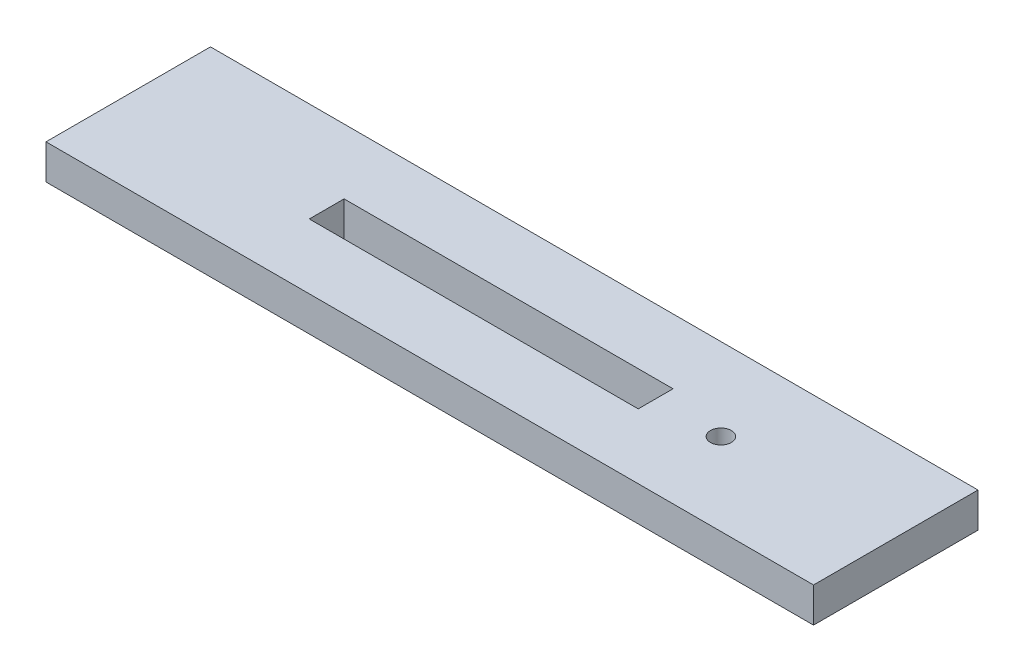
ISO-10303-21;
HEADER;
FILE_DESCRIPTION(('STEP AP214'),'2;1');
FILE_NAME('part.step','',(''),(''),'','','');
FILE_SCHEMA(('AUTOMOTIVE_DESIGN { 1 0 10303 214 1 1 1 1 }'));
ENDSEC;
DATA;
#1=APPLICATION_CONTEXT('core data for automotive mechanical design processes');
#2=APPLICATION_PROTOCOL_DEFINITION('international standard','automotive_design',2000,#1);
#3=PRODUCT_CONTEXT('',#1,'mechanical');
#4=PRODUCT('Part','Part','',(#3));
#5=PRODUCT_RELATED_PRODUCT_CATEGORY('part','',(#4));
#6=PRODUCT_DEFINITION_FORMATION('','',#4);
#7=PRODUCT_DEFINITION_CONTEXT('part definition',#1,'design');
#8=PRODUCT_DEFINITION('design','',#6,#7);
#9=PRODUCT_DEFINITION_SHAPE('','',#8);
#10=(LENGTH_UNIT() NAMED_UNIT(*) SI_UNIT(.MILLI.,.METRE.));
#11=(NAMED_UNIT(*) PLANE_ANGLE_UNIT() SI_UNIT($,.RADIAN.));
#12=(NAMED_UNIT(*) SI_UNIT($,.STERADIAN.) SOLID_ANGLE_UNIT());
#13=UNCERTAINTY_MEASURE_WITH_UNIT(LENGTH_MEASURE(1.E-05),#10,'distance_accuracy_value','');
#14=(GEOMETRIC_REPRESENTATION_CONTEXT(3) GLOBAL_UNCERTAINTY_ASSIGNED_CONTEXT((#13)) GLOBAL_UNIT_ASSIGNED_CONTEXT((#10,
#11,#12)) REPRESENTATION_CONTEXT('',''));
#15=CARTESIAN_POINT('',(0.,0.,0.));
#16=DIRECTION('',(0.,0.,1.));
#17=DIRECTION('',(1.,0.,0.));
#18=AXIS2_PLACEMENT_3D('',#15,#16,#17);
#19=CARTESIAN_POINT('',(0.,6.35,0.));
#20=DIRECTION('',(0.,-1.,0.));
#21=DIRECTION('',(0.,0.,-1.));
#22=AXIS2_PLACEMENT_3D('',#19,#20,#21);
#23=PLANE('',#22);
#24=CARTESIAN_POINT('',(38.1,6.35,2.43317159877705));
#25=DIRECTION('',(0.,1.,0.));
#26=DIRECTION('',(0.,0.,1.));
#27=AXIS2_PLACEMENT_3D('',#24,#25,#26);
#28=CIRCLE('',#27,1.9);
#29=CARTESIAN_POINT('',(38.1,6.35,4.33317159877705));
#30=VERTEX_POINT('',#29);
#31=EDGE_CURVE('E134',#30,#30,#28,.T.);
#32=ORIENTED_EDGE('',*,*,#31,.F.);
#33=EDGE_LOOP('',(#32));
#34=FACE_BOUND('',#33,.T.);
#35=DIRECTION('',(0.,0.,-1.));
#36=VECTOR('',#35,1.);
#37=CARTESIAN_POINT('',(70.,6.35,17.4331715987771));
#38=LINE('',#37,#36);
#39=CARTESIAN_POINT('',(70.,6.35,17.4331715987771));
#40=VERTEX_POINT('',#39);
#41=CARTESIAN_POINT('',(70.,6.35,-12.5668284012229));
#42=VERTEX_POINT('',#41);
#43=EDGE_CURVE('E140',#40,#42,#38,.T.);
#44=ORIENTED_EDGE('',*,*,#43,.T.);
#45=DIRECTION('',(-1.,0.,0.));
#46=VECTOR('',#45,1.);
#47=CARTESIAN_POINT('',(-70.,6.35,-12.5668284012229));
#48=LINE('',#47,#46);
#49=CARTESIAN_POINT('',(-70.,6.35,-12.5668284012229));
#50=VERTEX_POINT('',#49);
#51=EDGE_CURVE('E143',#42,#50,#48,.T.);
#52=ORIENTED_EDGE('',*,*,#51,.T.);
#53=DIRECTION('',(0.,0.,1.));
#54=VECTOR('',#53,1.);
#55=CARTESIAN_POINT('',(-70.,6.35,17.4331715987771));
#56=LINE('',#55,#54);
#57=CARTESIAN_POINT('',(-70.,6.35,17.4331715987771));
#58=VERTEX_POINT('',#57);
#59=EDGE_CURVE('E146',#50,#58,#56,.T.);
#60=ORIENTED_EDGE('',*,*,#59,.T.);
#61=DIRECTION('',(1.,0.,0.));
#62=VECTOR('',#61,1.);
#63=CARTESIAN_POINT('',(-70.,6.35,17.4331715987771));
#64=LINE('',#63,#62);
#65=EDGE_CURVE('E148',#58,#40,#64,.T.);
#66=ORIENTED_EDGE('',*,*,#65,.T.);
#67=EDGE_LOOP('',(#44,#52,#60,#66));
#68=FACE_BOUND('',#67,.T.);
#69=DIRECTION('',(0.,0.,1.));
#70=VECTOR('',#69,1.);
#71=CARTESIAN_POINT('',(-33.8,6.35,5.60817159877704));
#72=LINE('',#71,#70);
#73=CARTESIAN_POINT('',(-33.8,6.35,-0.741828401222962));
#74=VERTEX_POINT('',#73);
#75=CARTESIAN_POINT('',(-33.8,6.35,5.60817159877704));
#76=VERTEX_POINT('',#75);
#77=EDGE_CURVE('E98',#74,#76,#72,.T.);
#78=ORIENTED_EDGE('',*,*,#77,.F.);
#79=DIRECTION('',(-1.,0.,0.));
#80=VECTOR('',#79,1.);
#81=CARTESIAN_POINT('',(26.2,6.35,-0.741828401222999));
#82=LINE('',#81,#80);
#83=CARTESIAN_POINT('',(26.2,6.35,-0.741828401222999));
#84=VERTEX_POINT('',#83);
#85=EDGE_CURVE('E120',#84,#74,#82,.T.);
#86=ORIENTED_EDGE('',*,*,#85,.F.);
#87=DIRECTION('',(0.,0.,-1.));
#88=VECTOR('',#87,1.);
#89=CARTESIAN_POINT('',(26.2,6.35,5.60817159877703));
#90=LINE('',#89,#88);
#91=CARTESIAN_POINT('',(26.2,6.35,5.60817159877703));
#92=VERTEX_POINT('',#91);
#93=EDGE_CURVE('E118',#92,#84,#90,.T.);
#94=ORIENTED_EDGE('',*,*,#93,.F.);
#95=DIRECTION('',(1.,0.,0.));
#96=VECTOR('',#95,1.);
#97=CARTESIAN_POINT('',(26.2,6.35,5.60817159877703));
#98=LINE('',#97,#96);
#99=EDGE_CURVE('E106',#76,#92,#98,.T.);
#100=ORIENTED_EDGE('',*,*,#99,.F.);
#101=EDGE_LOOP('',(#78,#86,#94,#100));
#102=FACE_BOUND('',#101,.T.);
#103=ADVANCED_FACE('F33',(#34,#68,#102),#23,.F.);
#104=CARTESIAN_POINT('',(0.,0.,0.));
#105=DIRECTION('',(0.,-1.,0.));
#106=DIRECTION('',(0.,0.,-1.));
#107=AXIS2_PLACEMENT_3D('',#104,#105,#106);
#108=PLANE('',#107);
#109=DIRECTION('',(0.,0.,-1.));
#110=VECTOR('',#109,1.);
#111=CARTESIAN_POINT('',(70.,0.,17.4331715987771));
#112=LINE('',#111,#110);
#113=CARTESIAN_POINT('',(70.,0.,17.4331715987771));
#114=VERTEX_POINT('',#113);
#115=CARTESIAN_POINT('',(70.,0.,-12.5668284012229));
#116=VERTEX_POINT('',#115);
#117=EDGE_CURVE('E137',#114,#116,#112,.T.);
#118=ORIENTED_EDGE('',*,*,#117,.F.);
#119=DIRECTION('',(1.,0.,0.));
#120=VECTOR('',#119,1.);
#121=CARTESIAN_POINT('',(-70.,0.,17.4331715987771));
#122=LINE('',#121,#120);
#123=CARTESIAN_POINT('',(-70.,0.,17.4331715987771));
#124=VERTEX_POINT('',#123);
#125=EDGE_CURVE('E144',#124,#114,#122,.T.);
#126=ORIENTED_EDGE('',*,*,#125,.F.);
#127=DIRECTION('',(0.,0.,1.));
#128=VECTOR('',#127,1.);
#129=CARTESIAN_POINT('',(-70.,0.,17.4331715987771));
#130=LINE('',#129,#128);
#131=CARTESIAN_POINT('',(-70.,0.,-12.5668284012229));
#132=VERTEX_POINT('',#131);
#133=EDGE_CURVE('E155',#132,#124,#130,.T.);
#134=ORIENTED_EDGE('',*,*,#133,.F.);
#135=DIRECTION('',(-1.,0.,0.));
#136=VECTOR('',#135,1.);
#137=CARTESIAN_POINT('',(-70.,0.,-12.5668284012229));
#138=LINE('',#137,#136);
#139=EDGE_CURVE('E153',#116,#132,#138,.T.);
#140=ORIENTED_EDGE('',*,*,#139,.F.);
#141=EDGE_LOOP('',(#118,#126,#134,#140));
#142=FACE_BOUND('',#141,.T.);
#143=CARTESIAN_POINT('',(38.1,0.,2.43317159877705));
#144=DIRECTION('',(0.,1.,0.));
#145=DIRECTION('',(0.,0.,1.));
#146=AXIS2_PLACEMENT_3D('',#143,#144,#145);
#147=CIRCLE('',#146,1.9);
#148=CARTESIAN_POINT('',(38.1,0.,4.33317159877705));
#149=VERTEX_POINT('',#148);
#150=EDGE_CURVE('E114',#149,#149,#147,.T.);
#151=ORIENTED_EDGE('',*,*,#150,.T.);
#152=EDGE_LOOP('',(#151));
#153=FACE_BOUND('',#152,.T.);
#154=DIRECTION('',(-1.,0.,0.));
#155=VECTOR('',#154,1.);
#156=CARTESIAN_POINT('',(26.2,0.,-0.741828401222999));
#157=LINE('',#156,#155);
#158=CARTESIAN_POINT('',(26.2,0.,-0.741828401222999));
#159=VERTEX_POINT('',#158);
#160=CARTESIAN_POINT('',(-33.8,0.,-0.741828401222962));
#161=VERTEX_POINT('',#160);
#162=EDGE_CURVE('E107',#159,#161,#157,.T.);
#163=ORIENTED_EDGE('',*,*,#162,.T.);
#164=DIRECTION('',(0.,0.,1.));
#165=VECTOR('',#164,1.);
#166=CARTESIAN_POINT('',(-33.8,0.,5.60817159877704));
#167=LINE('',#166,#165);
#168=CARTESIAN_POINT('',(-33.8,0.,5.60817159877704));
#169=VERTEX_POINT('',#168);
#170=EDGE_CURVE('E56',#161,#169,#167,.T.);
#171=ORIENTED_EDGE('',*,*,#170,.T.);
#172=DIRECTION('',(1.,0.,0.));
#173=VECTOR('',#172,1.);
#174=CARTESIAN_POINT('',(26.2,0.,5.60817159877703));
#175=LINE('',#174,#173);
#176=CARTESIAN_POINT('',(26.2,0.,5.60817159877703));
#177=VERTEX_POINT('',#176);
#178=EDGE_CURVE('E113',#169,#177,#175,.T.);
#179=ORIENTED_EDGE('',*,*,#178,.T.);
#180=DIRECTION('',(0.,0.,-1.));
#181=VECTOR('',#180,1.);
#182=CARTESIAN_POINT('',(26.2,0.,5.60817159877703));
#183=LINE('',#182,#181);
#184=EDGE_CURVE('E126',#177,#159,#183,.T.);
#185=ORIENTED_EDGE('',*,*,#184,.T.);
#186=EDGE_LOOP('',(#163,#171,#179,#185));
#187=FACE_BOUND('',#186,.T.);
#188=ADVANCED_FACE('F173',(#142,#153,#187),#108,.T.);
#189=CARTESIAN_POINT('',(70.,6.35,17.4331715987771));
#190=DIRECTION('',(-1.,0.,0.));
#191=DIRECTION('',(0.,0.,1.));
#192=AXIS2_PLACEMENT_3D('',#189,#190,#191);
#193=PLANE('',#192);
#194=ORIENTED_EDGE('',*,*,#117,.T.);
#195=DIRECTION('',(0.,-1.,0.));
#196=VECTOR('',#195,1.);
#197=CARTESIAN_POINT('',(70.,6.35,-12.5668284012229));
#198=LINE('',#197,#196);
#199=EDGE_CURVE('E11',#42,#116,#198,.T.);
#200=ORIENTED_EDGE('',*,*,#199,.F.);
#201=ORIENTED_EDGE('',*,*,#43,.F.);
#202=DIRECTION('',(0.,-1.,0.));
#203=VECTOR('',#202,1.);
#204=CARTESIAN_POINT('',(70.,6.35,17.4331715987771));
#205=LINE('',#204,#203);
#206=EDGE_CURVE('E150',#40,#114,#205,.T.);
#207=ORIENTED_EDGE('',*,*,#206,.T.);
#208=EDGE_LOOP('',(#194,#200,#201,#207));
#209=FACE_BOUND('',#208,.T.);
#210=ADVANCED_FACE('F35',(#209),#193,.F.);
#211=CARTESIAN_POINT('',(-70.,6.35,-12.5668284012229));
#212=DIRECTION('',(0.,0.,1.));
#213=DIRECTION('',(1.,0.,0.));
#214=AXIS2_PLACEMENT_3D('',#211,#212,#213);
#215=PLANE('',#214);
#216=ORIENTED_EDGE('',*,*,#139,.T.);
#217=DIRECTION('',(0.,-1.,0.));
#218=VECTOR('',#217,1.);
#219=CARTESIAN_POINT('',(-70.,6.35,-12.5668284012229));
#220=LINE('',#219,#218);
#221=EDGE_CURVE('E41',#50,#132,#220,.T.);
#222=ORIENTED_EDGE('',*,*,#221,.F.);
#223=ORIENTED_EDGE('',*,*,#51,.F.);
#224=ORIENTED_EDGE('',*,*,#199,.T.);
#225=EDGE_LOOP('',(#216,#222,#223,#224));
#226=FACE_BOUND('',#225,.T.);
#227=ADVANCED_FACE('F183',(#226),#215,.F.);
#228=CARTESIAN_POINT('',(-70.,6.35,17.4331715987771));
#229=DIRECTION('',(1.,0.,0.));
#230=DIRECTION('',(0.,0.,-1.));
#231=AXIS2_PLACEMENT_3D('',#228,#229,#230);
#232=PLANE('',#231);
#233=ORIENTED_EDGE('',*,*,#133,.T.);
#234=DIRECTION('',(0.,-1.,0.));
#235=VECTOR('',#234,1.);
#236=CARTESIAN_POINT('',(-70.,6.35,17.4331715987771));
#237=LINE('',#236,#235);
#238=EDGE_CURVE('E160',#58,#124,#237,.T.);
#239=ORIENTED_EDGE('',*,*,#238,.F.);
#240=ORIENTED_EDGE('',*,*,#59,.F.);
#241=ORIENTED_EDGE('',*,*,#221,.T.);
#242=EDGE_LOOP('',(#233,#239,#240,#241));
#243=FACE_BOUND('',#242,.T.);
#244=ADVANCED_FACE('F167',(#243),#232,.F.);
#245=CARTESIAN_POINT('',(-70.,6.35,17.4331715987771));
#246=DIRECTION('',(0.,0.,-1.));
#247=DIRECTION('',(-1.,0.,0.));
#248=AXIS2_PLACEMENT_3D('',#245,#246,#247);
#249=PLANE('',#248);
#250=ORIENTED_EDGE('',*,*,#125,.T.);
#251=ORIENTED_EDGE('',*,*,#206,.F.);
#252=ORIENTED_EDGE('',*,*,#65,.F.);
#253=ORIENTED_EDGE('',*,*,#238,.T.);
#254=EDGE_LOOP('',(#250,#251,#252,#253));
#255=FACE_BOUND('',#254,.T.);
#256=ADVANCED_FACE('F177',(#255),#249,.F.);
#257=CARTESIAN_POINT('',(38.1,6.35,2.43317159877705));
#258=DIRECTION('',(0.,-1.,0.));
#259=DIRECTION('',(0.,0.,-1.));
#260=AXIS2_PLACEMENT_3D('',#257,#258,#259);
#261=CYLINDRICAL_SURFACE('',#260,1.9);
#262=ORIENTED_EDGE('',*,*,#31,.T.);
#263=EDGE_LOOP('',(#262));
#264=FACE_BOUND('',#263,.T.);
#265=ORIENTED_EDGE('',*,*,#150,.F.);
#266=EDGE_LOOP('',(#265));
#267=FACE_BOUND('',#266,.T.);
#268=ADVANCED_FACE('F199',(#264,#267),#261,.F.);
#269=CARTESIAN_POINT('',(-33.8,6.35,5.60817159877704));
#270=DIRECTION('',(1.,0.,0.));
#271=DIRECTION('',(0.,0.,-1.));
#272=AXIS2_PLACEMENT_3D('',#269,#270,#271);
#273=PLANE('',#272);
#274=ORIENTED_EDGE('',*,*,#170,.F.);
#275=DIRECTION('',(0.,-1.,0.));
#276=VECTOR('',#275,1.);
#277=CARTESIAN_POINT('',(-33.8,6.35,-0.741828401222962));
#278=LINE('',#277,#276);
#279=EDGE_CURVE('E102',#74,#161,#278,.T.);
#280=ORIENTED_EDGE('',*,*,#279,.F.);
#281=ORIENTED_EDGE('',*,*,#77,.T.);
#282=DIRECTION('',(0.,-1.,0.));
#283=VECTOR('',#282,1.);
#284=CARTESIAN_POINT('',(-33.8,6.35,5.60817159877704));
#285=LINE('',#284,#283);
#286=EDGE_CURVE('E101',#76,#169,#285,.T.);
#287=ORIENTED_EDGE('',*,*,#286,.T.);
#288=EDGE_LOOP('',(#274,#280,#281,#287));
#289=FACE_BOUND('',#288,.T.);
#290=ADVANCED_FACE('F100',(#289),#273,.T.);
#291=CARTESIAN_POINT('',(26.2,6.35,5.60817159877703));
#292=DIRECTION('',(0.,0.,-1.));
#293=DIRECTION('',(-1.,0.,0.));
#294=AXIS2_PLACEMENT_3D('',#291,#292,#293);
#295=PLANE('',#294);
#296=ORIENTED_EDGE('',*,*,#178,.F.);
#297=ORIENTED_EDGE('',*,*,#286,.F.);
#298=ORIENTED_EDGE('',*,*,#99,.T.);
#299=DIRECTION('',(0.,-1.,0.));
#300=VECTOR('',#299,1.);
#301=CARTESIAN_POINT('',(26.2,6.35,5.60817159877703));
#302=LINE('',#301,#300);
#303=EDGE_CURVE('E115',#92,#177,#302,.T.);
#304=ORIENTED_EDGE('',*,*,#303,.T.);
#305=EDGE_LOOP('',(#296,#297,#298,#304));
#306=FACE_BOUND('',#305,.T.);
#307=ADVANCED_FACE('F110',(#306),#295,.T.);
#308=CARTESIAN_POINT('',(26.2,6.35,5.60817159877703));
#309=DIRECTION('',(-1.,0.,0.));
#310=DIRECTION('',(0.,0.,1.));
#311=AXIS2_PLACEMENT_3D('',#308,#309,#310);
#312=PLANE('',#311);
#313=ORIENTED_EDGE('',*,*,#184,.F.);
#314=ORIENTED_EDGE('',*,*,#303,.F.);
#315=ORIENTED_EDGE('',*,*,#93,.T.);
#316=DIRECTION('',(0.,-1.,0.));
#317=VECTOR('',#316,1.);
#318=CARTESIAN_POINT('',(26.2,6.35,-0.741828401222999));
#319=LINE('',#318,#317);
#320=EDGE_CURVE('E48',#84,#159,#319,.T.);
#321=ORIENTED_EDGE('',*,*,#320,.T.);
#322=EDGE_LOOP('',(#313,#314,#315,#321));
#323=FACE_BOUND('',#322,.T.);
#324=ADVANCED_FACE('F216',(#323),#312,.T.);
#325=CARTESIAN_POINT('',(26.2,6.35,-0.741828401222999));
#326=DIRECTION('',(0.,0.,1.));
#327=DIRECTION('',(1.,0.,0.));
#328=AXIS2_PLACEMENT_3D('',#325,#326,#327);
#329=PLANE('',#328);
#330=ORIENTED_EDGE('',*,*,#162,.F.);
#331=ORIENTED_EDGE('',*,*,#320,.F.);
#332=ORIENTED_EDGE('',*,*,#85,.T.);
#333=ORIENTED_EDGE('',*,*,#279,.T.);
#334=EDGE_LOOP('',(#330,#331,#332,#333));
#335=FACE_BOUND('',#334,.T.);
#336=ADVANCED_FACE('F214',(#335),#329,.T.);
#337=CLOSED_SHELL('',(#103,#188,#210,#227,#244,#256,#268,#290,#307,#324,#336));
#338=MANIFOLD_SOLID_BREP('B2',#337);
#339=ADVANCED_BREP_SHAPE_REPRESENTATION('',(#18,#338),#14);
#340=SHAPE_DEFINITION_REPRESENTATION(#9,#339);
ENDSEC;
END-ISO-10303-21;
